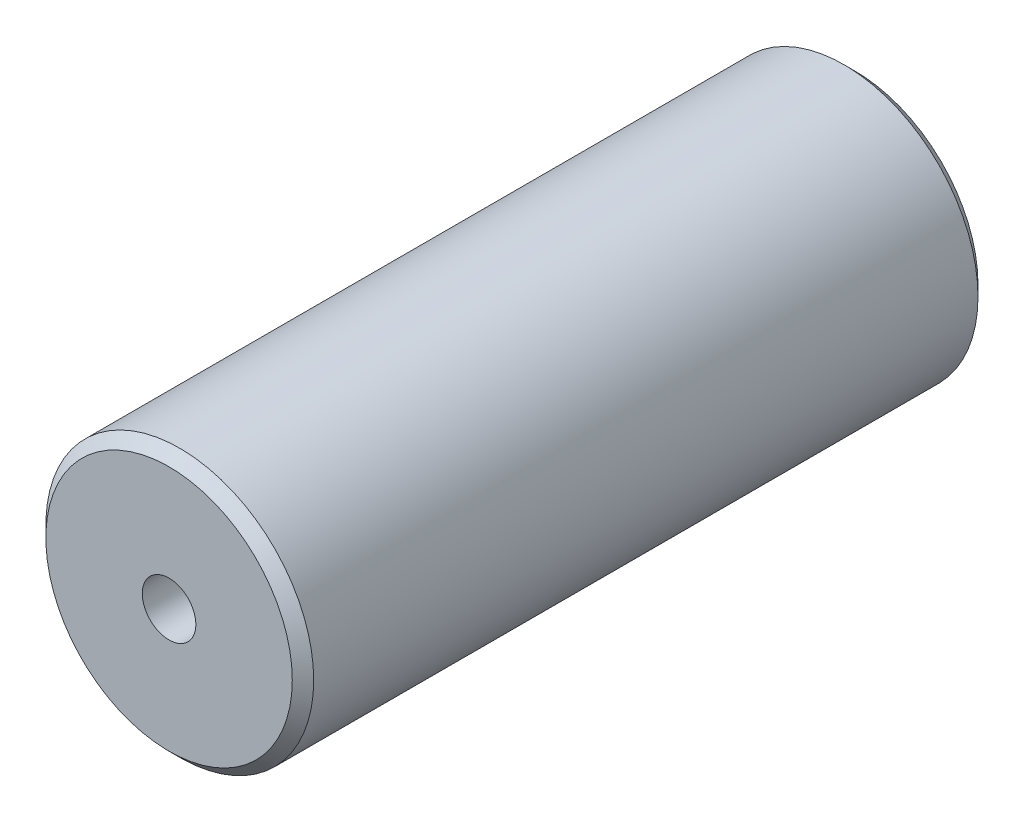
ISO-10303-21;
HEADER;
FILE_DESCRIPTION(('STEP AP214'),'2;1');
FILE_NAME('part.step','',(''),(''),'','','');
FILE_SCHEMA(('AUTOMOTIVE_DESIGN { 1 0 10303 214 1 1 1 1 }'));
ENDSEC;
DATA;
#1=APPLICATION_CONTEXT('core data for automotive mechanical design processes');
#2=APPLICATION_PROTOCOL_DEFINITION('international standard','automotive_design',2000,#1);
#3=PRODUCT_CONTEXT('',#1,'mechanical');
#4=PRODUCT('Part','Part','',(#3));
#5=PRODUCT_RELATED_PRODUCT_CATEGORY('part','',(#4));
#6=PRODUCT_DEFINITION_FORMATION('','',#4);
#7=PRODUCT_DEFINITION_CONTEXT('part definition',#1,'design');
#8=PRODUCT_DEFINITION('design','',#6,#7);
#9=PRODUCT_DEFINITION_SHAPE('','',#8);
#10=(LENGTH_UNIT() NAMED_UNIT(*) SI_UNIT(.MILLI.,.METRE.));
#11=(NAMED_UNIT(*) PLANE_ANGLE_UNIT() SI_UNIT($,.RADIAN.));
#12=(NAMED_UNIT(*) SI_UNIT($,.STERADIAN.) SOLID_ANGLE_UNIT());
#13=UNCERTAINTY_MEASURE_WITH_UNIT(LENGTH_MEASURE(1.E-05),#10,'distance_accuracy_value','');
#14=(GEOMETRIC_REPRESENTATION_CONTEXT(3) GLOBAL_UNCERTAINTY_ASSIGNED_CONTEXT((#13)) GLOBAL_UNIT_ASSIGNED_CONTEXT((#10,
#11,#12)) REPRESENTATION_CONTEXT('',''));
#15=CARTESIAN_POINT('',(0.,0.,0.));
#16=DIRECTION('',(0.,0.,1.));
#17=DIRECTION('',(1.,0.,0.));
#18=AXIS2_PLACEMENT_3D('',#15,#16,#17);
#19=CARTESIAN_POINT('',(0.,0.,32.));
#20=DIRECTION('',(0.,0.,-1.));
#21=DIRECTION('',(-1.,0.,0.));
#22=AXIS2_PLACEMENT_3D('',#19,#20,#21);
#23=CYLINDRICAL_SURFACE('',#22,12.5);
#24=CARTESIAN_POINT('',(0.,0.,-31.));
#25=DIRECTION('',(0.,0.,1.));
#26=DIRECTION('',(1.,0.,0.));
#27=AXIS2_PLACEMENT_3D('',#24,#25,#26);
#28=CIRCLE('',#27,12.5);
#29=CARTESIAN_POINT('',(12.5,0.,-31.));
#30=VERTEX_POINT('',#29);
#31=EDGE_CURVE('E81',#30,#30,#28,.T.);
#32=ORIENTED_EDGE('',*,*,#31,.T.);
#33=EDGE_LOOP('',(#32));
#34=FACE_BOUND('',#33,.T.);
#35=CARTESIAN_POINT('',(0.,0.,31.));
#36=DIRECTION('',(0.,0.,1.));
#37=DIRECTION('',(1.,0.,0.));
#38=AXIS2_PLACEMENT_3D('',#35,#36,#37);
#39=CIRCLE('',#38,12.5);
#40=CARTESIAN_POINT('',(12.5,0.,31.));
#41=VERTEX_POINT('',#40);
#42=EDGE_CURVE('E78',#41,#41,#39,.F.);
#43=ORIENTED_EDGE('',*,*,#42,.T.);
#44=EDGE_LOOP('',(#43));
#45=FACE_BOUND('',#44,.T.);
#46=ADVANCED_FACE('F42',(#34,#45),#23,.T.);
#47=CARTESIAN_POINT('',(0.,0.,32.));
#48=DIRECTION('',(0.,0.,1.));
#49=DIRECTION('',(1.,0.,0.));
#50=AXIS2_PLACEMENT_3D('',#47,#48,#49);
#51=PLANE('',#50);
#52=CARTESIAN_POINT('',(0.,0.,32.));
#53=DIRECTION('',(0.,0.,1.));
#54=DIRECTION('',(1.,0.,0.));
#55=AXIS2_PLACEMENT_3D('',#52,#53,#54);
#56=CIRCLE('',#55,2.49999999999999);
#57=CARTESIAN_POINT('',(2.49999999999999,0.,32.));
#58=VERTEX_POINT('',#57);
#59=EDGE_CURVE('E67',#58,#58,#56,.T.);
#60=ORIENTED_EDGE('',*,*,#59,.F.);
#61=EDGE_LOOP('',(#60));
#62=FACE_BOUND('',#61,.T.);
#63=CARTESIAN_POINT('',(0.,0.,32.));
#64=DIRECTION('',(0.,0.,1.));
#65=DIRECTION('',(1.,0.,0.));
#66=AXIS2_PLACEMENT_3D('',#63,#64,#65);
#67=CIRCLE('',#66,11.5);
#68=CARTESIAN_POINT('',(11.5,0.,32.));
#69=VERTEX_POINT('',#68);
#70=EDGE_CURVE('E11',#69,#69,#67,.T.);
#71=ORIENTED_EDGE('',*,*,#70,.T.);
#72=EDGE_LOOP('',(#71));
#73=FACE_BOUND('',#72,.T.);
#74=ADVANCED_FACE('F95',(#62,#73),#51,.T.);
#75=CARTESIAN_POINT('',(0.,0.,-32.));
#76=DIRECTION('',(0.,0.,1.));
#77=DIRECTION('',(1.,0.,0.));
#78=AXIS2_PLACEMENT_3D('',#75,#76,#77);
#79=PLANE('',#78);
#80=CARTESIAN_POINT('',(0.,0.,-32.));
#81=DIRECTION('',(0.,0.,-1.));
#82=DIRECTION('',(-1.,0.,0.));
#83=AXIS2_PLACEMENT_3D('',#80,#81,#82);
#84=CIRCLE('',#83,2.49999999999999);
#85=CARTESIAN_POINT('',(-2.49999999999999,0.,-32.));
#86=VERTEX_POINT('',#85);
#87=EDGE_CURVE('E68',#86,#86,#84,.T.);
#88=ORIENTED_EDGE('',*,*,#87,.F.);
#89=EDGE_LOOP('',(#88));
#90=FACE_BOUND('',#89,.T.);
#91=CARTESIAN_POINT('',(0.,0.,-32.));
#92=DIRECTION('',(0.,0.,1.));
#93=DIRECTION('',(1.,0.,0.));
#94=AXIS2_PLACEMENT_3D('',#91,#92,#93);
#95=CIRCLE('',#94,11.5);
#96=CARTESIAN_POINT('',(11.5,0.,-32.));
#97=VERTEX_POINT('',#96);
#98=EDGE_CURVE('E51',#97,#97,#95,.F.);
#99=ORIENTED_EDGE('',*,*,#98,.T.);
#100=EDGE_LOOP('',(#99));
#101=FACE_BOUND('',#100,.T.);
#102=ADVANCED_FACE('F86',(#90,#101),#79,.F.);
#103=CARTESIAN_POINT('',(0.,0.,-31.));
#104=DIRECTION('',(0.,0.,1.));
#105=DIRECTION('',(1.,0.,0.));
#106=AXIS2_PLACEMENT_3D('',#103,#104,#105);
#107=CONICAL_SURFACE('',#106,12.5,0.785398163397458);
#108=ORIENTED_EDGE('',*,*,#98,.F.);
#109=EDGE_LOOP('',(#108));
#110=FACE_BOUND('',#109,.T.);
#111=ORIENTED_EDGE('',*,*,#31,.F.);
#112=EDGE_LOOP('',(#111));
#113=FACE_BOUND('',#112,.T.);
#114=ADVANCED_FACE('F88',(#110,#113),#107,.T.);
#115=CARTESIAN_POINT('',(0.,0.,32.));
#116=DIRECTION('',(0.,0.,-1.));
#117=DIRECTION('',(-1.,0.,0.));
#118=AXIS2_PLACEMENT_3D('',#115,#116,#117);
#119=CONICAL_SURFACE('',#118,11.5,0.785398163397447);
#120=ORIENTED_EDGE('',*,*,#42,.F.);
#121=EDGE_LOOP('',(#120));
#122=FACE_BOUND('',#121,.T.);
#123=ORIENTED_EDGE('',*,*,#70,.F.);
#124=EDGE_LOOP('',(#123));
#125=FACE_BOUND('',#124,.T.);
#126=ADVANCED_FACE('F45',(#122,#125),#119,.T.);
#127=CARTESIAN_POINT('',(0.,0.,17.));
#128=DIRECTION('',(0.,0.,1.));
#129=DIRECTION('',(1.,0.,0.));
#130=AXIS2_PLACEMENT_3D('',#127,#128,#129);
#131=CONICAL_SURFACE('',#130,2.5,1.02974425867665);
#132=CARTESIAN_POINT('',(0.,0.,15.4978484524311));
#133=VERTEX_POINT('',#132);
#134=VERTEX_LOOP('',#133);
#135=FACE_BOUND('',#134,.T.);
#136=CARTESIAN_POINT('',(0.,0.,17.));
#137=DIRECTION('',(0.,0.,1.));
#138=DIRECTION('',(1.,0.,0.));
#139=AXIS2_PLACEMENT_3D('',#136,#137,#138);
#140=CIRCLE('',#139,2.5);
#141=CARTESIAN_POINT('',(2.5,0.,17.));
#142=VERTEX_POINT('',#141);
#143=EDGE_CURVE('E71',#142,#142,#140,.T.);
#144=ORIENTED_EDGE('',*,*,#143,.T.);
#145=EDGE_LOOP('',(#144));
#146=FACE_BOUND('',#145,.T.);
#147=ADVANCED_FACE('F101',(#135,#146),#131,.F.);
#148=CARTESIAN_POINT('',(0.,0.,32.));
#149=DIRECTION('',(0.,0.,1.));
#150=DIRECTION('',(1.,0.,0.));
#151=AXIS2_PLACEMENT_3D('',#148,#149,#150);
#152=CYLINDRICAL_SURFACE('',#151,2.49999999999999);
#153=ORIENTED_EDGE('',*,*,#143,.F.);
#154=EDGE_LOOP('',(#153));
#155=FACE_BOUND('',#154,.T.);
#156=ORIENTED_EDGE('',*,*,#59,.T.);
#157=EDGE_LOOP('',(#156));
#158=FACE_BOUND('',#157,.T.);
#159=ADVANCED_FACE('F61',(#155,#158),#152,.F.);
#160=CARTESIAN_POINT('',(0.,0.,-17.));
#161=DIRECTION('',(0.,0.,-1.));
#162=DIRECTION('',(-1.,0.,0.));
#163=AXIS2_PLACEMENT_3D('',#160,#161,#162);
#164=CONICAL_SURFACE('',#163,2.5,1.02974425867665);
#165=CARTESIAN_POINT('',(0.,0.,-15.4978484524311));
#166=VERTEX_POINT('',#165);
#167=VERTEX_LOOP('',#166);
#168=FACE_BOUND('',#167,.T.);
#169=CARTESIAN_POINT('',(0.,0.,-17.));
#170=DIRECTION('',(0.,0.,-1.));
#171=DIRECTION('',(-1.,0.,0.));
#172=AXIS2_PLACEMENT_3D('',#169,#170,#171);
#173=CIRCLE('',#172,2.5);
#174=CARTESIAN_POINT('',(-2.5,0.,-17.));
#175=VERTEX_POINT('',#174);
#176=EDGE_CURVE('E65',#175,#175,#173,.T.);
#177=ORIENTED_EDGE('',*,*,#176,.T.);
#178=EDGE_LOOP('',(#177));
#179=FACE_BOUND('',#178,.T.);
#180=ADVANCED_FACE('F57',(#168,#179),#164,.F.);
#181=CARTESIAN_POINT('',(0.,0.,-32.));
#182=DIRECTION('',(0.,0.,-1.));
#183=DIRECTION('',(-1.,0.,0.));
#184=AXIS2_PLACEMENT_3D('',#181,#182,#183);
#185=CYLINDRICAL_SURFACE('',#184,2.49999999999999);
#186=ORIENTED_EDGE('',*,*,#176,.F.);
#187=EDGE_LOOP('',(#186));
#188=FACE_BOUND('',#187,.T.);
#189=ORIENTED_EDGE('',*,*,#87,.T.);
#190=EDGE_LOOP('',(#189));
#191=FACE_BOUND('',#190,.T.);
#192=ADVANCED_FACE('F60',(#188,#191),#185,.F.);
#193=CLOSED_SHELL('',(#46,#74,#102,#114,#126,#147,#159,#180,#192));
#194=MANIFOLD_SOLID_BREP('B2',#193);
#195=ADVANCED_BREP_SHAPE_REPRESENTATION('',(#18,#194),#14);
#196=SHAPE_DEFINITION_REPRESENTATION(#9,#195);
ENDSEC;
END-ISO-10303-21;
